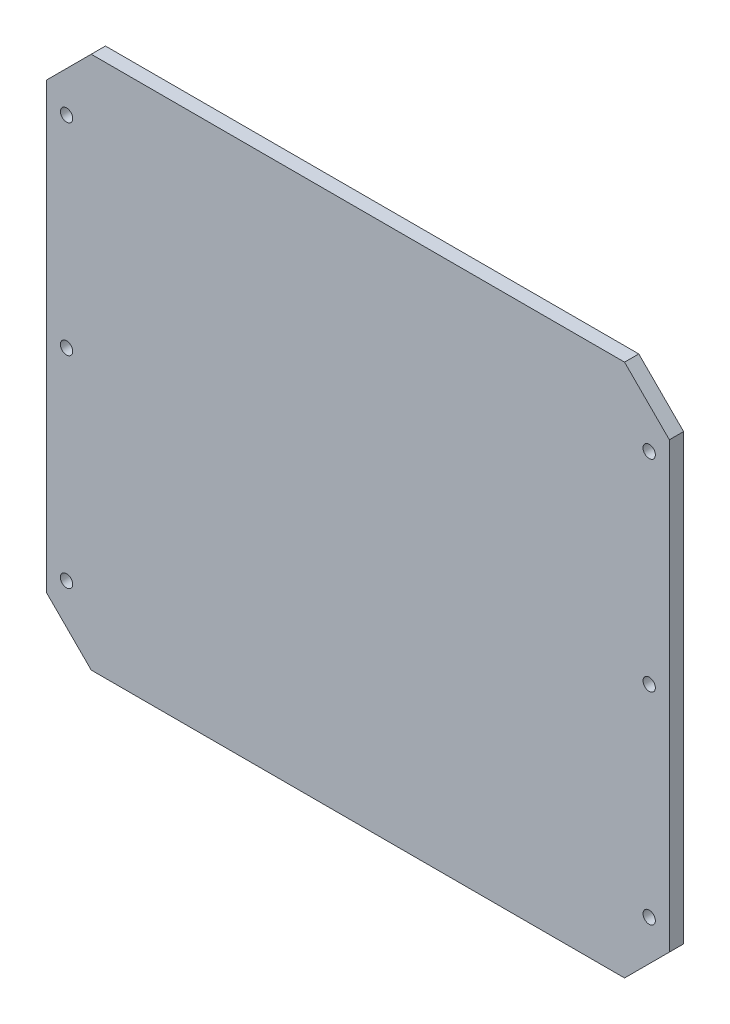
ISO-10303-21;
HEADER;
FILE_DESCRIPTION(('STEP AP214'),'2;1');
FILE_NAME('part.step','',(''),(''),'','','');
FILE_SCHEMA(('AUTOMOTIVE_DESIGN { 1 0 10303 214 1 1 1 1 }'));
ENDSEC;
DATA;
#1=APPLICATION_CONTEXT('core data for automotive mechanical design processes');
#2=APPLICATION_PROTOCOL_DEFINITION('international standard','automotive_design',2000,#1);
#3=PRODUCT_CONTEXT('',#1,'mechanical');
#4=PRODUCT('Part','Part','',(#3));
#5=PRODUCT_RELATED_PRODUCT_CATEGORY('part','',(#4));
#6=PRODUCT_DEFINITION_FORMATION('','',#4);
#7=PRODUCT_DEFINITION_CONTEXT('part definition',#1,'design');
#8=PRODUCT_DEFINITION('design','',#6,#7);
#9=PRODUCT_DEFINITION_SHAPE('','',#8);
#10=(LENGTH_UNIT() NAMED_UNIT(*) SI_UNIT(.MILLI.,.METRE.));
#11=(NAMED_UNIT(*) PLANE_ANGLE_UNIT() SI_UNIT($,.RADIAN.));
#12=(NAMED_UNIT(*) SI_UNIT($,.STERADIAN.) SOLID_ANGLE_UNIT());
#13=UNCERTAINTY_MEASURE_WITH_UNIT(LENGTH_MEASURE(1.E-05),#10,'distance_accuracy_value','');
#14=(GEOMETRIC_REPRESENTATION_CONTEXT(3) GLOBAL_UNCERTAINTY_ASSIGNED_CONTEXT((#13)) GLOBAL_UNIT_ASSIGNED_CONTEXT((#10,
#11,#12)) REPRESENTATION_CONTEXT('',''));
#15=CARTESIAN_POINT('',(0.,0.,0.));
#16=DIRECTION('',(0.,0.,1.));
#17=DIRECTION('',(1.,0.,0.));
#18=AXIS2_PLACEMENT_3D('',#15,#16,#17);
#19=CARTESIAN_POINT('',(-139.,-119.,6.35));
#20=DIRECTION('',(1.,0.,0.));
#21=DIRECTION('',(0.,0.,-1.));
#22=AXIS2_PLACEMENT_3D('',#19,#20,#21);
#23=PLANE('',#22);
#24=DIRECTION('',(0.,-1.,0.));
#25=VECTOR('',#24,1.);
#26=CARTESIAN_POINT('',(-139.,-119.,6.35));
#27=LINE('',#26,#25);
#28=CARTESIAN_POINT('',(-139.,98.9999999999999,6.35));
#29=VERTEX_POINT('',#28);
#30=CARTESIAN_POINT('',(-139.,-98.9999999999999,6.35));
#31=VERTEX_POINT('',#30);
#32=EDGE_CURVE('E129',#29,#31,#27,.T.);
#33=ORIENTED_EDGE('',*,*,#32,.F.);
#34=DIRECTION('',(0.,0.,-1.));
#35=VECTOR('',#34,1.);
#36=CARTESIAN_POINT('',(-139.,99.,6.35));
#37=LINE('',#36,#35);
#38=CARTESIAN_POINT('',(-139.,98.9999999999999,0.));
#39=VERTEX_POINT('',#38);
#40=EDGE_CURVE('E11',#29,#39,#37,.T.);
#41=ORIENTED_EDGE('',*,*,#40,.T.);
#42=DIRECTION('',(0.,-1.,0.));
#43=VECTOR('',#42,1.);
#44=CARTESIAN_POINT('',(-139.,-119.,0.));
#45=LINE('',#44,#43);
#46=CARTESIAN_POINT('',(-139.,-98.9999999999999,0.));
#47=VERTEX_POINT('',#46);
#48=EDGE_CURVE('E131',#39,#47,#45,.T.);
#49=ORIENTED_EDGE('',*,*,#48,.T.);
#50=DIRECTION('',(0.,0.,1.));
#51=VECTOR('',#50,1.);
#52=CARTESIAN_POINT('',(-139.,-98.9999999999999,6.35));
#53=LINE('',#52,#51);
#54=EDGE_CURVE('E41',#47,#31,#53,.T.);
#55=ORIENTED_EDGE('',*,*,#54,.T.);
#56=EDGE_LOOP('',(#33,#41,#49,#55));
#57=FACE_BOUND('',#56,.T.);
#58=ADVANCED_FACE('F32',(#57),#23,.F.);
#59=CARTESIAN_POINT('',(139.,-119.,6.35));
#60=DIRECTION('',(0.,1.,0.));
#61=DIRECTION('',(-1.,0.,0.));
#62=AXIS2_PLACEMENT_3D('',#59,#60,#61);
#63=PLANE('',#62);
#64=DIRECTION('',(1.,0.,0.));
#65=VECTOR('',#64,1.);
#66=CARTESIAN_POINT('',(139.,-119.,0.));
#67=LINE('',#66,#65);
#68=CARTESIAN_POINT('',(-119.,-119.,0.));
#69=VERTEX_POINT('',#68);
#70=CARTESIAN_POINT('',(119.,-119.,0.));
#71=VERTEX_POINT('',#70);
#72=EDGE_CURVE('E127',#69,#71,#67,.T.);
#73=ORIENTED_EDGE('',*,*,#72,.T.);
#74=DIRECTION('',(0.,0.,1.));
#75=VECTOR('',#74,1.);
#76=CARTESIAN_POINT('',(119.,-119.,6.35));
#77=LINE('',#76,#75);
#78=CARTESIAN_POINT('',(119.,-119.,6.35));
#79=VERTEX_POINT('',#78);
#80=EDGE_CURVE('E106',#71,#79,#77,.T.);
#81=ORIENTED_EDGE('',*,*,#80,.T.);
#82=DIRECTION('',(1.,0.,0.));
#83=VECTOR('',#82,1.);
#84=CARTESIAN_POINT('',(139.,-119.,6.35));
#85=LINE('',#84,#83);
#86=CARTESIAN_POINT('',(-119.,-119.,6.35));
#87=VERTEX_POINT('',#86);
#88=EDGE_CURVE('E194',#87,#79,#85,.T.);
#89=ORIENTED_EDGE('',*,*,#88,.F.);
#90=DIRECTION('',(0.,0.,-1.));
#91=VECTOR('',#90,1.);
#92=CARTESIAN_POINT('',(-119.,-119.,6.35));
#93=LINE('',#92,#91);
#94=EDGE_CURVE('E111',#87,#69,#93,.T.);
#95=ORIENTED_EDGE('',*,*,#94,.T.);
#96=EDGE_LOOP('',(#73,#81,#89,#95));
#97=FACE_BOUND('',#96,.T.);
#98=ADVANCED_FACE('F210',(#97),#63,.F.);
#99=CARTESIAN_POINT('',(139.,-119.,6.35));
#100=DIRECTION('',(-1.,0.,0.));
#101=DIRECTION('',(0.,0.,1.));
#102=AXIS2_PLACEMENT_3D('',#99,#100,#101);
#103=PLANE('',#102);
#104=DIRECTION('',(0.,1.,0.));
#105=VECTOR('',#104,1.);
#106=CARTESIAN_POINT('',(139.,-119.,6.35));
#107=LINE('',#106,#105);
#108=CARTESIAN_POINT('',(139.,-99.0000000000001,6.35));
#109=VERTEX_POINT('',#108);
#110=CARTESIAN_POINT('',(139.,98.9999999999999,6.35));
#111=VERTEX_POINT('',#110);
#112=EDGE_CURVE('E120',#109,#111,#107,.T.);
#113=ORIENTED_EDGE('',*,*,#112,.F.);
#114=DIRECTION('',(0.,0.,-1.));
#115=VECTOR('',#114,1.);
#116=CARTESIAN_POINT('',(139.,-99.,6.35));
#117=LINE('',#116,#115);
#118=CARTESIAN_POINT('',(139.,-99.,0.));
#119=VERTEX_POINT('',#118);
#120=EDGE_CURVE('E105',#109,#119,#117,.T.);
#121=ORIENTED_EDGE('',*,*,#120,.T.);
#122=DIRECTION('',(0.,1.,0.));
#123=VECTOR('',#122,1.);
#124=CARTESIAN_POINT('',(139.,-119.,0.));
#125=LINE('',#124,#123);
#126=CARTESIAN_POINT('',(139.,98.9999999999999,0.));
#127=VERTEX_POINT('',#126);
#128=EDGE_CURVE('E118',#119,#127,#125,.T.);
#129=ORIENTED_EDGE('',*,*,#128,.T.);
#130=DIRECTION('',(0.,0.,1.));
#131=VECTOR('',#130,1.);
#132=CARTESIAN_POINT('',(139.,98.9999999999999,6.35));
#133=LINE('',#132,#131);
#134=EDGE_CURVE('E122',#127,#111,#133,.T.);
#135=ORIENTED_EDGE('',*,*,#134,.T.);
#136=EDGE_LOOP('',(#113,#121,#129,#135));
#137=FACE_BOUND('',#136,.T.);
#138=ADVANCED_FACE('F117',(#137),#103,.F.);
#139=CARTESIAN_POINT('',(139.,119.,6.35));
#140=DIRECTION('',(0.,-1.,0.));
#141=DIRECTION('',(1.,0.,0.));
#142=AXIS2_PLACEMENT_3D('',#139,#140,#141);
#143=PLANE('',#142);
#144=DIRECTION('',(-1.,0.,0.));
#145=VECTOR('',#144,1.);
#146=CARTESIAN_POINT('',(139.,119.,6.35));
#147=LINE('',#146,#145);
#148=CARTESIAN_POINT('',(119.,119.,6.35));
#149=VERTEX_POINT('',#148);
#150=CARTESIAN_POINT('',(-119.,119.,6.35));
#151=VERTEX_POINT('',#150);
#152=EDGE_CURVE('E135',#149,#151,#147,.T.);
#153=ORIENTED_EDGE('',*,*,#152,.F.);
#154=DIRECTION('',(0.,0.,-1.));
#155=VECTOR('',#154,1.);
#156=CARTESIAN_POINT('',(119.,119.,6.35));
#157=LINE('',#156,#155);
#158=CARTESIAN_POINT('',(119.,119.,0.));
#159=VERTEX_POINT('',#158);
#160=EDGE_CURVE('E152',#149,#159,#157,.T.);
#161=ORIENTED_EDGE('',*,*,#160,.T.);
#162=DIRECTION('',(-1.,0.,0.));
#163=VECTOR('',#162,1.);
#164=CARTESIAN_POINT('',(139.,119.,0.));
#165=LINE('',#164,#163);
#166=CARTESIAN_POINT('',(-119.,119.,0.));
#167=VERTEX_POINT('',#166);
#168=EDGE_CURVE('E126',#159,#167,#165,.T.);
#169=ORIENTED_EDGE('',*,*,#168,.T.);
#170=DIRECTION('',(0.,0.,1.));
#171=VECTOR('',#170,1.);
#172=CARTESIAN_POINT('',(-119.,119.,6.35));
#173=LINE('',#172,#171);
#174=EDGE_CURVE('E49',#167,#151,#173,.T.);
#175=ORIENTED_EDGE('',*,*,#174,.T.);
#176=EDGE_LOOP('',(#153,#161,#169,#175));
#177=FACE_BOUND('',#176,.T.);
#178=ADVANCED_FACE('F217',(#177),#143,.F.);
#179=CARTESIAN_POINT('',(0.,0.,6.35));
#180=DIRECTION('',(0.,0.,1.));
#181=DIRECTION('',(1.,0.,0.));
#182=AXIS2_PLACEMENT_3D('',#179,#180,#181);
#183=PLANE('',#182);
#184=CARTESIAN_POINT('',(130.,90.,6.35));
#185=DIRECTION('',(0.,0.,1.));
#186=DIRECTION('',(-1.,0.,0.));
#187=AXIS2_PLACEMENT_3D('',#184,#185,#186);
#188=CIRCLE('',#187,2.75000000000001);
#189=CARTESIAN_POINT('',(127.25,90.,6.35));
#190=VERTEX_POINT('',#189);
#191=EDGE_CURVE('E183',#190,#190,#188,.T.);
#192=ORIENTED_EDGE('',*,*,#191,.F.);
#193=EDGE_LOOP('',(#192));
#194=FACE_BOUND('',#193,.T.);
#195=CARTESIAN_POINT('',(129.999999999998,0.,6.35));
#196=DIRECTION('',(0.,0.,1.));
#197=DIRECTION('',(-1.,0.,0.));
#198=AXIS2_PLACEMENT_3D('',#195,#196,#197);
#199=CIRCLE('',#198,2.75000000000001);
#200=CARTESIAN_POINT('',(127.249999999998,0.,6.35));
#201=VERTEX_POINT('',#200);
#202=EDGE_CURVE('E173',#201,#201,#199,.T.);
#203=ORIENTED_EDGE('',*,*,#202,.F.);
#204=EDGE_LOOP('',(#203));
#205=FACE_BOUND('',#204,.T.);
#206=CARTESIAN_POINT('',(130.,-90.,6.35));
#207=DIRECTION('',(0.,0.,1.));
#208=DIRECTION('',(1.,0.,0.));
#209=AXIS2_PLACEMENT_3D('',#206,#207,#208);
#210=CIRCLE('',#209,2.75000000000001);
#211=CARTESIAN_POINT('',(132.75,-90.,6.35));
#212=VERTEX_POINT('',#211);
#213=EDGE_CURVE('E170',#212,#212,#210,.T.);
#214=ORIENTED_EDGE('',*,*,#213,.F.);
#215=EDGE_LOOP('',(#214));
#216=FACE_BOUND('',#215,.T.);
#217=CARTESIAN_POINT('',(-129.999999999998,0.,6.35));
#218=DIRECTION('',(0.,0.,1.));
#219=DIRECTION('',(1.,0.,0.));
#220=AXIS2_PLACEMENT_3D('',#217,#218,#219);
#221=CIRCLE('',#220,2.75000000000001);
#222=CARTESIAN_POINT('',(-127.249999999998,0.,6.35));
#223=VERTEX_POINT('',#222);
#224=EDGE_CURVE('E167',#223,#223,#221,.T.);
#225=ORIENTED_EDGE('',*,*,#224,.F.);
#226=EDGE_LOOP('',(#225));
#227=FACE_BOUND('',#226,.T.);
#228=CARTESIAN_POINT('',(-130.,-90.,6.35));
#229=DIRECTION('',(0.,0.,1.));
#230=DIRECTION('',(-1.,0.,0.));
#231=AXIS2_PLACEMENT_3D('',#228,#229,#230);
#232=CIRCLE('',#231,2.75000000000001);
#233=CARTESIAN_POINT('',(-132.75,-90.,6.35));
#234=VERTEX_POINT('',#233);
#235=EDGE_CURVE('E163',#234,#234,#232,.T.);
#236=ORIENTED_EDGE('',*,*,#235,.F.);
#237=EDGE_LOOP('',(#236));
#238=FACE_BOUND('',#237,.T.);
#239=CARTESIAN_POINT('',(-130.,90.,6.35));
#240=DIRECTION('',(0.,0.,1.));
#241=DIRECTION('',(1.,0.,0.));
#242=AXIS2_PLACEMENT_3D('',#239,#240,#241);
#243=CIRCLE('',#242,2.75000000000001);
#244=CARTESIAN_POINT('',(-127.25,90.,6.35));
#245=VERTEX_POINT('',#244);
#246=EDGE_CURVE('E159',#245,#245,#243,.T.);
#247=ORIENTED_EDGE('',*,*,#246,.F.);
#248=EDGE_LOOP('',(#247));
#249=FACE_BOUND('',#248,.T.);
#250=ORIENTED_EDGE('',*,*,#88,.T.);
#251=DIRECTION('',(-0.707106781186549,-0.707106781186547,0.));
#252=VECTOR('',#251,1.);
#253=CARTESIAN_POINT('',(119.,-119.,6.35));
#254=LINE('',#253,#252);
#255=EDGE_CURVE('E149',#79,#109,#254,.F.);
#256=ORIENTED_EDGE('',*,*,#255,.T.);
#257=ORIENTED_EDGE('',*,*,#112,.T.);
#258=DIRECTION('',(0.707106781186545,-0.70710678118655,0.));
#259=VECTOR('',#258,1.);
#260=CARTESIAN_POINT('',(119.000000000001,119.,6.35));
#261=LINE('',#260,#259);
#262=EDGE_CURVE('E56',#111,#149,#261,.F.);
#263=ORIENTED_EDGE('',*,*,#262,.T.);
#264=ORIENTED_EDGE('',*,*,#152,.T.);
#265=DIRECTION('',(0.707106781186548,0.707106781186547,0.));
#266=VECTOR('',#265,1.);
#267=CARTESIAN_POINT('',(-119.,119.,6.35));
#268=LINE('',#267,#266);
#269=EDGE_CURVE('E146',#151,#29,#268,.F.);
#270=ORIENTED_EDGE('',*,*,#269,.T.);
#271=ORIENTED_EDGE('',*,*,#32,.T.);
#272=DIRECTION('',(-0.707106781186546,0.70710678118655,0.));
#273=VECTOR('',#272,1.);
#274=CARTESIAN_POINT('',(-119.,-119.,6.35));
#275=LINE('',#274,#273);
#276=EDGE_CURVE('E144',#31,#87,#275,.F.);
#277=ORIENTED_EDGE('',*,*,#276,.T.);
#278=EDGE_LOOP('',(#250,#256,#257,#263,#264,#270,#271,#277));
#279=FACE_BOUND('',#278,.T.);
#280=ADVANCED_FACE('F208',(#194,#205,#216,#227,#238,#249,#279),#183,.T.);
#281=CARTESIAN_POINT('',(0.,0.,0.));
#282=DIRECTION('',(0.,0.,1.));
#283=DIRECTION('',(1.,0.,0.));
#284=AXIS2_PLACEMENT_3D('',#281,#282,#283);
#285=PLANE('',#284);
#286=CARTESIAN_POINT('',(130.,90.,0.));
#287=DIRECTION('',(0.,0.,1.));
#288=DIRECTION('',(1.,0.,0.));
#289=AXIS2_PLACEMENT_3D('',#286,#287,#288);
#290=CIRCLE('',#289,2.75000000000001);
#291=CARTESIAN_POINT('',(132.75,90.,0.));
#292=VERTEX_POINT('',#291);
#293=EDGE_CURVE('E36',#292,#292,#290,.T.);
#294=ORIENTED_EDGE('',*,*,#293,.T.);
#295=EDGE_LOOP('',(#294));
#296=FACE_BOUND('',#295,.T.);
#297=CARTESIAN_POINT('',(129.999999999998,0.,0.));
#298=DIRECTION('',(0.,0.,1.));
#299=DIRECTION('',(1.,0.,0.));
#300=AXIS2_PLACEMENT_3D('',#297,#298,#299);
#301=CIRCLE('',#300,2.75000000000001);
#302=CARTESIAN_POINT('',(132.749999999998,0.,0.));
#303=VERTEX_POINT('',#302);
#304=EDGE_CURVE('E171',#303,#303,#301,.T.);
#305=ORIENTED_EDGE('',*,*,#304,.T.);
#306=EDGE_LOOP('',(#305));
#307=FACE_BOUND('',#306,.T.);
#308=CARTESIAN_POINT('',(130.,-90.,0.));
#309=DIRECTION('',(0.,0.,1.));
#310=DIRECTION('',(1.,0.,0.));
#311=AXIS2_PLACEMENT_3D('',#308,#309,#310);
#312=CIRCLE('',#311,2.75000000000001);
#313=CARTESIAN_POINT('',(132.75,-90.,0.));
#314=VERTEX_POINT('',#313);
#315=EDGE_CURVE('E168',#314,#314,#312,.T.);
#316=ORIENTED_EDGE('',*,*,#315,.T.);
#317=EDGE_LOOP('',(#316));
#318=FACE_BOUND('',#317,.T.);
#319=CARTESIAN_POINT('',(-129.999999999998,0.,0.));
#320=DIRECTION('',(0.,0.,1.));
#321=DIRECTION('',(1.,0.,0.));
#322=AXIS2_PLACEMENT_3D('',#319,#320,#321);
#323=CIRCLE('',#322,2.75000000000001);
#324=CARTESIAN_POINT('',(-127.249999999998,0.,0.));
#325=VERTEX_POINT('',#324);
#326=EDGE_CURVE('E164',#325,#325,#323,.T.);
#327=ORIENTED_EDGE('',*,*,#326,.T.);
#328=EDGE_LOOP('',(#327));
#329=FACE_BOUND('',#328,.T.);
#330=CARTESIAN_POINT('',(-130.,-90.,0.));
#331=DIRECTION('',(0.,0.,1.));
#332=DIRECTION('',(1.,0.,0.));
#333=AXIS2_PLACEMENT_3D('',#330,#331,#332);
#334=CIRCLE('',#333,2.75000000000001);
#335=CARTESIAN_POINT('',(-127.25,-90.,0.));
#336=VERTEX_POINT('',#335);
#337=EDGE_CURVE('E160',#336,#336,#334,.T.);
#338=ORIENTED_EDGE('',*,*,#337,.T.);
#339=EDGE_LOOP('',(#338));
#340=FACE_BOUND('',#339,.T.);
#341=CARTESIAN_POINT('',(-130.,90.,0.));
#342=DIRECTION('',(0.,0.,1.));
#343=DIRECTION('',(1.,0.,0.));
#344=AXIS2_PLACEMENT_3D('',#341,#342,#343);
#345=CIRCLE('',#344,2.75000000000001);
#346=CARTESIAN_POINT('',(-127.25,90.,0.));
#347=VERTEX_POINT('',#346);
#348=EDGE_CURVE('E156',#347,#347,#345,.T.);
#349=ORIENTED_EDGE('',*,*,#348,.T.);
#350=EDGE_LOOP('',(#349));
#351=FACE_BOUND('',#350,.T.);
#352=ORIENTED_EDGE('',*,*,#128,.F.);
#353=DIRECTION('',(0.707106781186549,0.707106781186547,0.));
#354=VECTOR('',#353,1.);
#355=CARTESIAN_POINT('',(139.,-99.,0.));
#356=LINE('',#355,#354);
#357=EDGE_CURVE('E101',#119,#71,#356,.F.);
#358=ORIENTED_EDGE('',*,*,#357,.T.);
#359=ORIENTED_EDGE('',*,*,#72,.F.);
#360=DIRECTION('',(0.707106781186546,-0.70710678118655,0.));
#361=VECTOR('',#360,1.);
#362=CARTESIAN_POINT('',(-119.,-119.,0.));
#363=LINE('',#362,#361);
#364=EDGE_CURVE('E121',#69,#47,#363,.F.);
#365=ORIENTED_EDGE('',*,*,#364,.T.);
#366=ORIENTED_EDGE('',*,*,#48,.F.);
#367=DIRECTION('',(-0.707106781186548,-0.707106781186547,0.));
#368=VECTOR('',#367,1.);
#369=CARTESIAN_POINT('',(-139.,99.,0.));
#370=LINE('',#369,#368);
#371=EDGE_CURVE('E138',#39,#167,#370,.F.);
#372=ORIENTED_EDGE('',*,*,#371,.T.);
#373=ORIENTED_EDGE('',*,*,#168,.F.);
#374=DIRECTION('',(-0.707106781186545,0.70710678118655,0.));
#375=VECTOR('',#374,1.);
#376=CARTESIAN_POINT('',(119.,119.,0.));
#377=LINE('',#376,#375);
#378=EDGE_CURVE('E112',#159,#127,#377,.F.);
#379=ORIENTED_EDGE('',*,*,#378,.T.);
#380=EDGE_LOOP('',(#352,#358,#359,#365,#366,#372,#373,#379));
#381=FACE_BOUND('',#380,.T.);
#382=ADVANCED_FACE('F124',(#296,#307,#318,#329,#340,#351,#381),#285,.F.);
#383=CARTESIAN_POINT('',(139.,-99.,6.35));
#384=DIRECTION('',(-0.707106781186546,0.707106781186548,0.));
#385=DIRECTION('',(0.,0.,-1.));
#386=AXIS2_PLACEMENT_3D('',#383,#384,#385);
#387=PLANE('',#386);
#388=ORIENTED_EDGE('',*,*,#255,.F.);
#389=ORIENTED_EDGE('',*,*,#80,.F.);
#390=ORIENTED_EDGE('',*,*,#357,.F.);
#391=ORIENTED_EDGE('',*,*,#120,.F.);
#392=EDGE_LOOP('',(#388,#389,#390,#391));
#393=FACE_BOUND('',#392,.T.);
#394=ADVANCED_FACE('F104',(#393),#387,.F.);
#395=CARTESIAN_POINT('',(119.,119.,6.35));
#396=DIRECTION('',(-0.707106781186551,-0.707106781186545,0.));
#397=DIRECTION('',(0.,0.,-1.));
#398=AXIS2_PLACEMENT_3D('',#395,#396,#397);
#399=PLANE('',#398);
#400=ORIENTED_EDGE('',*,*,#262,.F.);
#401=ORIENTED_EDGE('',*,*,#134,.F.);
#402=ORIENTED_EDGE('',*,*,#378,.F.);
#403=ORIENTED_EDGE('',*,*,#160,.F.);
#404=EDGE_LOOP('',(#400,#401,#402,#403));
#405=FACE_BOUND('',#404,.T.);
#406=ADVANCED_FACE('F224',(#405),#399,.F.);
#407=CARTESIAN_POINT('',(-139.,99.,6.35));
#408=DIRECTION('',(0.707106781186547,-0.707106781186548,0.));
#409=DIRECTION('',(0.,0.,-1.));
#410=AXIS2_PLACEMENT_3D('',#407,#408,#409);
#411=PLANE('',#410);
#412=ORIENTED_EDGE('',*,*,#269,.F.);
#413=ORIENTED_EDGE('',*,*,#174,.F.);
#414=ORIENTED_EDGE('',*,*,#371,.F.);
#415=ORIENTED_EDGE('',*,*,#40,.F.);
#416=EDGE_LOOP('',(#412,#413,#414,#415));
#417=FACE_BOUND('',#416,.T.);
#418=ADVANCED_FACE('F226',(#417),#411,.F.);
#419=CARTESIAN_POINT('',(-119.,-119.,6.35));
#420=DIRECTION('',(0.707106781186549,0.707106781186545,0.));
#421=DIRECTION('',(0.,0.,-1.));
#422=AXIS2_PLACEMENT_3D('',#419,#420,#421);
#423=PLANE('',#422);
#424=ORIENTED_EDGE('',*,*,#276,.F.);
#425=ORIENTED_EDGE('',*,*,#54,.F.);
#426=ORIENTED_EDGE('',*,*,#364,.F.);
#427=ORIENTED_EDGE('',*,*,#94,.F.);
#428=EDGE_LOOP('',(#424,#425,#426,#427));
#429=FACE_BOUND('',#428,.T.);
#430=ADVANCED_FACE('F34',(#429),#423,.F.);
#431=CARTESIAN_POINT('',(-130.,90.,-69.85));
#432=DIRECTION('',(0.,0.,1.));
#433=DIRECTION('',(1.,0.,0.));
#434=AXIS2_PLACEMENT_3D('',#431,#432,#433);
#435=CYLINDRICAL_SURFACE('',#434,2.75000000000001);
#436=ORIENTED_EDGE('',*,*,#246,.T.);
#437=EDGE_LOOP('',(#436));
#438=FACE_BOUND('',#437,.T.);
#439=ORIENTED_EDGE('',*,*,#348,.F.);
#440=EDGE_LOOP('',(#439));
#441=FACE_BOUND('',#440,.T.);
#442=ADVANCED_FACE('F233',(#438,#441),#435,.F.);
#443=CARTESIAN_POINT('',(-130.,-90.,-69.85));
#444=DIRECTION('',(0.,0.,1.));
#445=DIRECTION('',(1.,0.,0.));
#446=AXIS2_PLACEMENT_3D('',#443,#444,#445);
#447=CYLINDRICAL_SURFACE('',#446,2.75000000000001);
#448=ORIENTED_EDGE('',*,*,#235,.T.);
#449=EDGE_LOOP('',(#448));
#450=FACE_BOUND('',#449,.T.);
#451=ORIENTED_EDGE('',*,*,#337,.F.);
#452=EDGE_LOOP('',(#451));
#453=FACE_BOUND('',#452,.T.);
#454=ADVANCED_FACE('F248',(#450,#453),#447,.F.);
#455=CARTESIAN_POINT('',(-129.999999999998,0.,-69.85));
#456=DIRECTION('',(0.,0.,1.));
#457=DIRECTION('',(1.,0.,0.));
#458=AXIS2_PLACEMENT_3D('',#455,#456,#457);
#459=CYLINDRICAL_SURFACE('',#458,2.75000000000001);
#460=ORIENTED_EDGE('',*,*,#224,.T.);
#461=EDGE_LOOP('',(#460));
#462=FACE_BOUND('',#461,.T.);
#463=ORIENTED_EDGE('',*,*,#326,.F.);
#464=EDGE_LOOP('',(#463));
#465=FACE_BOUND('',#464,.T.);
#466=ADVANCED_FACE('F252',(#462,#465),#459,.F.);
#467=CARTESIAN_POINT('',(130.,-90.,-69.85));
#468=DIRECTION('',(0.,0.,1.));
#469=DIRECTION('',(1.,0.,0.));
#470=AXIS2_PLACEMENT_3D('',#467,#468,#469);
#471=CYLINDRICAL_SURFACE('',#470,2.75000000000001);
#472=ORIENTED_EDGE('',*,*,#213,.T.);
#473=EDGE_LOOP('',(#472));
#474=FACE_BOUND('',#473,.T.);
#475=ORIENTED_EDGE('',*,*,#315,.F.);
#476=EDGE_LOOP('',(#475));
#477=FACE_BOUND('',#476,.T.);
#478=ADVANCED_FACE('F256',(#474,#477),#471,.F.);
#479=CARTESIAN_POINT('',(129.999999999998,0.,-69.85));
#480=DIRECTION('',(0.,0.,1.));
#481=DIRECTION('',(1.,0.,0.));
#482=AXIS2_PLACEMENT_3D('',#479,#480,#481);
#483=CYLINDRICAL_SURFACE('',#482,2.75000000000001);
#484=ORIENTED_EDGE('',*,*,#202,.T.);
#485=EDGE_LOOP('',(#484));
#486=FACE_BOUND('',#485,.T.);
#487=ORIENTED_EDGE('',*,*,#304,.F.);
#488=EDGE_LOOP('',(#487));
#489=FACE_BOUND('',#488,.T.);
#490=ADVANCED_FACE('F260',(#486,#489),#483,.F.);
#491=CARTESIAN_POINT('',(130.,90.,-69.85));
#492=DIRECTION('',(0.,0.,1.));
#493=DIRECTION('',(1.,0.,0.));
#494=AXIS2_PLACEMENT_3D('',#491,#492,#493);
#495=CYLINDRICAL_SURFACE('',#494,2.75000000000001);
#496=ORIENTED_EDGE('',*,*,#191,.T.);
#497=EDGE_LOOP('',(#496));
#498=FACE_BOUND('',#497,.T.);
#499=ORIENTED_EDGE('',*,*,#293,.F.);
#500=EDGE_LOOP('',(#499));
#501=FACE_BOUND('',#500,.T.);
#502=ADVANCED_FACE('F264',(#498,#501),#495,.F.);
#503=CLOSED_SHELL('',(#58,#98,#138,#178,#280,#382,#394,#406,#418,#430,#442,#454,#466,#478,#490,#502));
#504=MANIFOLD_SOLID_BREP('B2',#503);
#505=ADVANCED_BREP_SHAPE_REPRESENTATION('',(#18,#504),#14);
#506=SHAPE_DEFINITION_REPRESENTATION(#9,#505);
ENDSEC;
END-ISO-10303-21;
